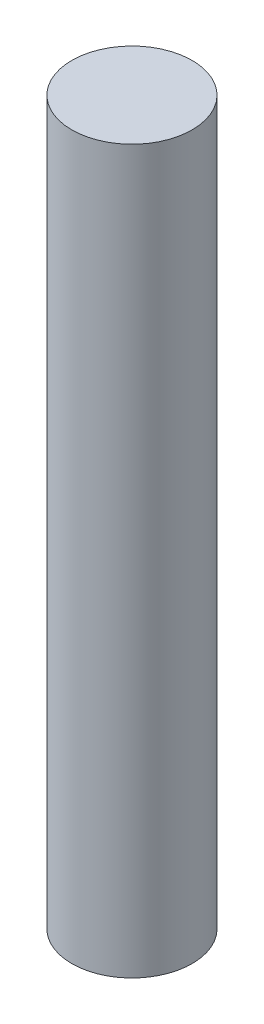
ISO-10303-21;
HEADER;
FILE_DESCRIPTION(('STEP AP214'),'2;1');
FILE_NAME('part.step','',(''),(''),'','','');
FILE_SCHEMA(('AUTOMOTIVE_DESIGN { 1 0 10303 214 1 1 1 1 }'));
ENDSEC;
DATA;
#1=APPLICATION_CONTEXT('core data for automotive mechanical design processes');
#2=APPLICATION_PROTOCOL_DEFINITION('international standard','automotive_design',2000,#1);
#3=PRODUCT_CONTEXT('',#1,'mechanical');
#4=PRODUCT('Part','Part','',(#3));
#5=PRODUCT_RELATED_PRODUCT_CATEGORY('part','',(#4));
#6=PRODUCT_DEFINITION_FORMATION('','',#4);
#7=PRODUCT_DEFINITION_CONTEXT('part definition',#1,'design');
#8=PRODUCT_DEFINITION('design','',#6,#7);
#9=PRODUCT_DEFINITION_SHAPE('','',#8);
#10=(LENGTH_UNIT() NAMED_UNIT(*) SI_UNIT(.MILLI.,.METRE.));
#11=(NAMED_UNIT(*) PLANE_ANGLE_UNIT() SI_UNIT($,.RADIAN.));
#12=(NAMED_UNIT(*) SI_UNIT($,.STERADIAN.) SOLID_ANGLE_UNIT());
#13=UNCERTAINTY_MEASURE_WITH_UNIT(LENGTH_MEASURE(1.E-05),#10,'distance_accuracy_value','');
#14=(GEOMETRIC_REPRESENTATION_CONTEXT(3) GLOBAL_UNCERTAINTY_ASSIGNED_CONTEXT((#13)) GLOBAL_UNIT_ASSIGNED_CONTEXT((#10,
#11,#12)) REPRESENTATION_CONTEXT('',''));
#15=CARTESIAN_POINT('',(0.,0.,0.));
#16=DIRECTION('',(0.,0.,1.));
#17=DIRECTION('',(1.,0.,0.));
#18=AXIS2_PLACEMENT_3D('',#15,#16,#17);
#19=CARTESIAN_POINT('',(0.,30.,0.));
#20=DIRECTION('',(0.,-1.,0.));
#21=DIRECTION('',(0.,0.,-1.));
#22=AXIS2_PLACEMENT_3D('',#19,#20,#21);
#23=CYLINDRICAL_SURFACE('',#22,2.5);
#24=CARTESIAN_POINT('',(0.,30.,0.));
#25=DIRECTION('',(0.,1.,0.));
#26=DIRECTION('',(0.,0.,1.));
#27=AXIS2_PLACEMENT_3D('',#24,#25,#26);
#28=CIRCLE('',#27,2.5);
#29=CARTESIAN_POINT('',(0.,30.,2.5));
#30=VERTEX_POINT('',#29);
#31=EDGE_CURVE('E10',#30,#30,#28,.T.);
#32=ORIENTED_EDGE('',*,*,#31,.F.);
#33=EDGE_LOOP('',(#32));
#34=FACE_BOUND('',#33,.T.);
#35=CARTESIAN_POINT('',(0.,0.,0.));
#36=DIRECTION('',(0.,1.,0.));
#37=DIRECTION('',(0.,0.,1.));
#38=AXIS2_PLACEMENT_3D('',#35,#36,#37);
#39=CIRCLE('',#38,2.5);
#40=CARTESIAN_POINT('',(0.,0.,2.5));
#41=VERTEX_POINT('',#40);
#42=EDGE_CURVE('E41',#41,#41,#39,.T.);
#43=ORIENTED_EDGE('',*,*,#42,.T.);
#44=EDGE_LOOP('',(#43));
#45=FACE_BOUND('',#44,.T.);
#46=ADVANCED_FACE('F38',(#34,#45),#23,.T.);
#47=CARTESIAN_POINT('',(0.,30.,0.));
#48=DIRECTION('',(0.,1.,0.));
#49=DIRECTION('',(0.,0.,1.));
#50=AXIS2_PLACEMENT_3D('',#47,#48,#49);
#51=PLANE('',#50);
#52=ORIENTED_EDGE('',*,*,#31,.T.);
#53=EDGE_LOOP('',(#52));
#54=FACE_BOUND('',#53,.T.);
#55=ADVANCED_FACE('F55',(#54),#51,.T.);
#56=CARTESIAN_POINT('',(0.,0.,0.));
#57=DIRECTION('',(0.,1.,0.));
#58=DIRECTION('',(0.,0.,1.));
#59=AXIS2_PLACEMENT_3D('',#56,#57,#58);
#60=PLANE('',#59);
#61=ORIENTED_EDGE('',*,*,#42,.F.);
#62=EDGE_LOOP('',(#61));
#63=FACE_BOUND('',#62,.T.);
#64=ADVANCED_FACE('F53',(#63),#60,.F.);
#65=CLOSED_SHELL('',(#46,#55,#64));
#66=MANIFOLD_SOLID_BREP('B2',#65);
#67=ADVANCED_BREP_SHAPE_REPRESENTATION('',(#18,#66),#14);
#68=SHAPE_DEFINITION_REPRESENTATION(#9,#67);
ENDSEC;
END-ISO-10303-21;
